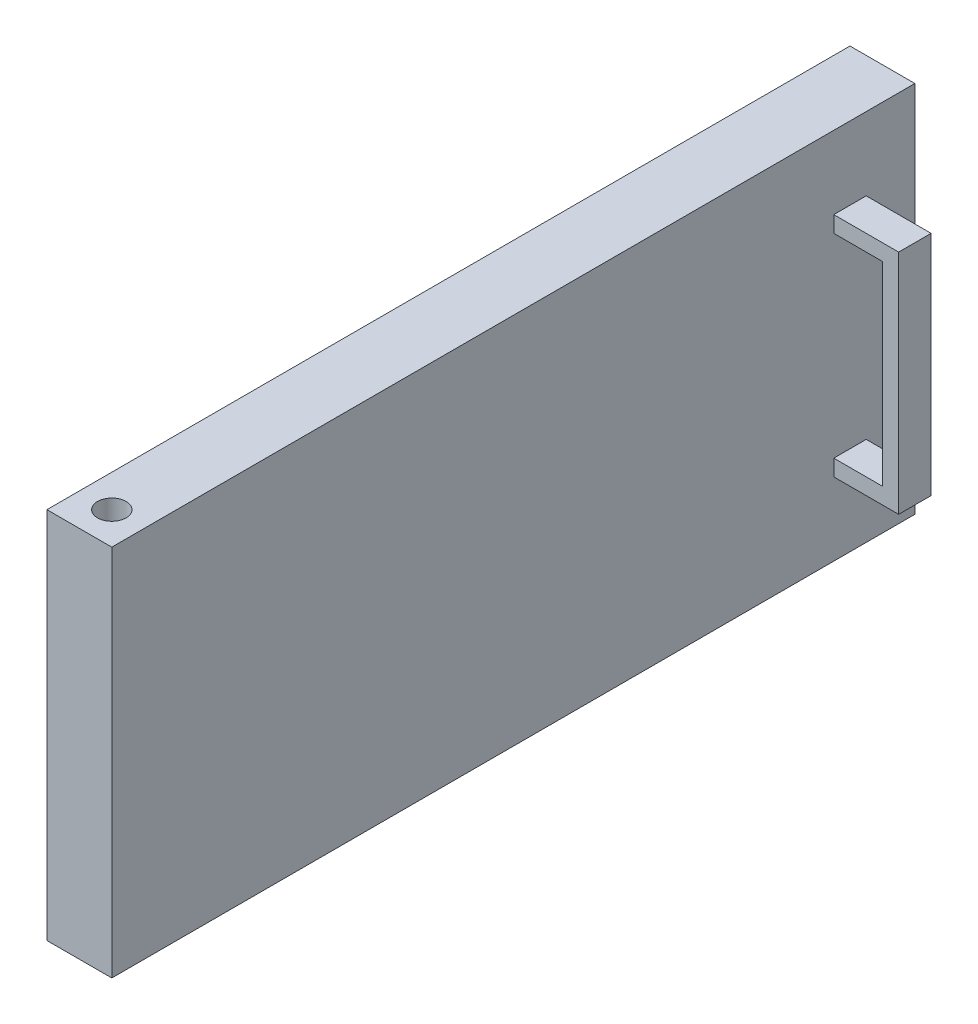
ISO-10303-21;
HEADER;
FILE_DESCRIPTION(('STEP AP214'),'2;1');
FILE_NAME('part.step','',(''),(''),'','','');
FILE_SCHEMA(('AUTOMOTIVE_DESIGN { 1 0 10303 214 1 1 1 1 }'));
ENDSEC;
DATA;
#1=APPLICATION_CONTEXT('core data for automotive mechanical design processes');
#2=APPLICATION_PROTOCOL_DEFINITION('international standard','automotive_design',2000,#1);
#3=PRODUCT_CONTEXT('',#1,'mechanical');
#4=PRODUCT('Part','Part','',(#3));
#5=PRODUCT_RELATED_PRODUCT_CATEGORY('part','',(#4));
#6=PRODUCT_DEFINITION_FORMATION('','',#4);
#7=PRODUCT_DEFINITION_CONTEXT('part definition',#1,'design');
#8=PRODUCT_DEFINITION('design','',#6,#7);
#9=PRODUCT_DEFINITION_SHAPE('','',#8);
#10=(LENGTH_UNIT() NAMED_UNIT(*) SI_UNIT(.MILLI.,.METRE.));
#11=(NAMED_UNIT(*) PLANE_ANGLE_UNIT() SI_UNIT($,.RADIAN.));
#12=(NAMED_UNIT(*) SI_UNIT($,.STERADIAN.) SOLID_ANGLE_UNIT());
#13=UNCERTAINTY_MEASURE_WITH_UNIT(LENGTH_MEASURE(1.E-05),#10,'distance_accuracy_value','');
#14=(GEOMETRIC_REPRESENTATION_CONTEXT(3) GLOBAL_UNCERTAINTY_ASSIGNED_CONTEXT((#13)) GLOBAL_UNIT_ASSIGNED_CONTEXT((#10,
#11,#12)) REPRESENTATION_CONTEXT('',''));
#15=CARTESIAN_POINT('',(0.,0.,0.));
#16=DIRECTION('',(0.,0.,1.));
#17=DIRECTION('',(1.,0.,0.));
#18=AXIS2_PLACEMENT_3D('',#15,#16,#17);
#19=CARTESIAN_POINT('',(20.,0.,0.));
#20=DIRECTION('',(1.,0.,0.));
#21=DIRECTION('',(0.,0.,-1.));
#22=AXIS2_PLACEMENT_3D('',#19,#20,#21);
#23=PLANE('',#22);
#24=DIRECTION('',(0.,-1.,0.));
#25=VECTOR('',#24,1.);
#26=CARTESIAN_POINT('',(20.,35.,-98.7499999999999));
#27=LINE('',#26,#25);
#28=CARTESIAN_POINT('',(20.,-30.,-98.7499999999999));
#29=VERTEX_POINT('',#28);
#30=CARTESIAN_POINT('',(20.,-35.,-98.7499999999999));
#31=VERTEX_POINT('',#30);
#32=EDGE_CURVE('E152',#29,#31,#27,.T.);
#33=ORIENTED_EDGE('',*,*,#32,.F.);
#34=DIRECTION('',(0.,0.,-1.));
#35=VECTOR('',#34,1.);
#36=CARTESIAN_POINT('',(20.,-30.,-88.75));
#37=LINE('',#36,#35);
#38=CARTESIAN_POINT('',(20.,-30.,-108.75));
#39=VERTEX_POINT('',#38);
#40=EDGE_CURVE('E142',#29,#39,#37,.T.);
#41=ORIENTED_EDGE('',*,*,#40,.T.);
#42=DIRECTION('',(0.,1.,0.));
#43=VECTOR('',#42,1.);
#44=CARTESIAN_POINT('',(20.,35.,-108.75));
#45=LINE('',#44,#43);
#46=CARTESIAN_POINT('',(20.,-35.,-108.75));
#47=VERTEX_POINT('',#46);
#48=EDGE_CURVE('E170',#47,#39,#45,.T.);
#49=ORIENTED_EDGE('',*,*,#48,.F.);
#50=DIRECTION('',(0.,0.,-1.));
#51=VECTOR('',#50,1.);
#52=CARTESIAN_POINT('',(20.,-35.,-98.7499999999999));
#53=LINE('',#52,#51);
#54=EDGE_CURVE('E167',#31,#47,#53,.T.);
#55=ORIENTED_EDGE('',*,*,#54,.F.);
#56=EDGE_LOOP('',(#33,#41,#49,#55));
#57=FACE_BOUND('',#56,.T.);
#58=DIRECTION('',(0.,0.,-1.));
#59=VECTOR('',#58,1.);
#60=CARTESIAN_POINT('',(20.,30.,-88.75));
#61=LINE('',#60,#59);
#62=CARTESIAN_POINT('',(20.,30.,-98.7499999999999));
#63=VERTEX_POINT('',#62);
#64=CARTESIAN_POINT('',(20.,30.,-108.75));
#65=VERTEX_POINT('',#64);
#66=EDGE_CURVE('E53',#63,#65,#61,.T.);
#67=ORIENTED_EDGE('',*,*,#66,.F.);
#68=CARTESIAN_POINT('',(20.,35.,-98.7499999999999));
#69=VERTEX_POINT('',#68);
#70=EDGE_CURVE('E164',#69,#63,#27,.T.);
#71=ORIENTED_EDGE('',*,*,#70,.F.);
#72=DIRECTION('',(0.,0.,1.));
#73=VECTOR('',#72,1.);
#74=CARTESIAN_POINT('',(20.,35.,-98.7499999999999));
#75=LINE('',#74,#73);
#76=CARTESIAN_POINT('',(20.,35.,-108.75));
#77=VERTEX_POINT('',#76);
#78=EDGE_CURVE('E157',#77,#69,#75,.T.);
#79=ORIENTED_EDGE('',*,*,#78,.F.);
#80=EDGE_CURVE('E169',#65,#77,#45,.T.);
#81=ORIENTED_EDGE('',*,*,#80,.F.);
#82=EDGE_LOOP('',(#67,#71,#79,#81));
#83=FACE_BOUND('',#82,.T.);
#84=DIRECTION('',(0.,1.,0.));
#85=VECTOR('',#84,1.);
#86=CARTESIAN_POINT('',(20.,57.5,-123.75));
#87=LINE('',#86,#85);
#88=CARTESIAN_POINT('',(20.,-57.5,-123.75));
#89=VERTEX_POINT('',#88);
#90=CARTESIAN_POINT('',(20.,57.5,-123.75));
#91=VERTEX_POINT('',#90);
#92=EDGE_CURVE('E197',#89,#91,#87,.T.);
#93=ORIENTED_EDGE('',*,*,#92,.T.);
#94=DIRECTION('',(0.,0.,1.));
#95=VECTOR('',#94,1.);
#96=CARTESIAN_POINT('',(20.,57.5,123.75));
#97=LINE('',#96,#95);
#98=CARTESIAN_POINT('',(20.,57.5,123.75));
#99=VERTEX_POINT('',#98);
#100=EDGE_CURVE('E200',#91,#99,#97,.T.);
#101=ORIENTED_EDGE('',*,*,#100,.T.);
#102=DIRECTION('',(0.,-1.,0.));
#103=VECTOR('',#102,1.);
#104=CARTESIAN_POINT('',(20.,57.5,123.75));
#105=LINE('',#104,#103);
#106=CARTESIAN_POINT('',(20.,-57.5,123.75));
#107=VERTEX_POINT('',#106);
#108=EDGE_CURVE('E203',#99,#107,#105,.T.);
#109=ORIENTED_EDGE('',*,*,#108,.T.);
#110=DIRECTION('',(0.,0.,-1.));
#111=VECTOR('',#110,1.);
#112=CARTESIAN_POINT('',(20.,-57.5,123.75));
#113=LINE('',#112,#111);
#114=EDGE_CURVE('E205',#107,#89,#113,.T.);
#115=ORIENTED_EDGE('',*,*,#114,.T.);
#116=EDGE_LOOP('',(#93,#101,#109,#115));
#117=FACE_BOUND('',#116,.T.);
#118=ADVANCED_FACE('F33',(#57,#83,#117),#23,.T.);
#119=CARTESIAN_POINT('',(20.,57.5,-123.75));
#120=DIRECTION('',(0.,0.,1.));
#121=DIRECTION('',(0.,-1.,0.));
#122=AXIS2_PLACEMENT_3D('',#119,#120,#121);
#123=PLANE('',#122);
#124=DIRECTION('',(0.,1.,0.));
#125=VECTOR('',#124,1.);
#126=CARTESIAN_POINT('',(0.,57.5,-123.75));
#127=LINE('',#126,#125);
#128=CARTESIAN_POINT('',(0.,-57.5,-123.75));
#129=VERTEX_POINT('',#128);
#130=CARTESIAN_POINT('',(0.,57.5,-123.75));
#131=VERTEX_POINT('',#130);
#132=EDGE_CURVE('E194',#129,#131,#127,.T.);
#133=ORIENTED_EDGE('',*,*,#132,.T.);
#134=DIRECTION('',(-1.,0.,0.));
#135=VECTOR('',#134,1.);
#136=CARTESIAN_POINT('',(20.,57.5,-123.75));
#137=LINE('',#136,#135);
#138=EDGE_CURVE('E11',#91,#131,#137,.T.);
#139=ORIENTED_EDGE('',*,*,#138,.F.);
#140=ORIENTED_EDGE('',*,*,#92,.F.);
#141=DIRECTION('',(-1.,0.,0.));
#142=VECTOR('',#141,1.);
#143=CARTESIAN_POINT('',(20.,-57.5,-123.75));
#144=LINE('',#143,#142);
#145=EDGE_CURVE('E207',#89,#129,#144,.T.);
#146=ORIENTED_EDGE('',*,*,#145,.T.);
#147=EDGE_LOOP('',(#133,#139,#140,#146));
#148=FACE_BOUND('',#147,.T.);
#149=ADVANCED_FACE('F35',(#148),#123,.F.);
#150=CARTESIAN_POINT('',(20.,57.5,123.75));
#151=DIRECTION('',(0.,-1.,0.));
#152=DIRECTION('',(0.,0.,-1.));
#153=AXIS2_PLACEMENT_3D('',#150,#151,#152);
#154=PLANE('',#153);
#155=CARTESIAN_POINT('',(10.,57.5,113.75));
#156=DIRECTION('',(0.,1.,0.));
#157=DIRECTION('',(0.,0.,1.));
#158=AXIS2_PLACEMENT_3D('',#155,#156,#157);
#159=CIRCLE('',#158,4.4);
#160=CARTESIAN_POINT('',(10.,57.5,118.15));
#161=VERTEX_POINT('',#160);
#162=EDGE_CURVE('E188',#161,#161,#159,.T.);
#163=ORIENTED_EDGE('',*,*,#162,.F.);
#164=EDGE_LOOP('',(#163));
#165=FACE_BOUND('',#164,.T.);
#166=DIRECTION('',(0.,0.,1.));
#167=VECTOR('',#166,1.);
#168=CARTESIAN_POINT('',(0.,57.5,123.75));
#169=LINE('',#168,#167);
#170=CARTESIAN_POINT('',(0.,57.5,123.75));
#171=VERTEX_POINT('',#170);
#172=EDGE_CURVE('E210',#131,#171,#169,.T.);
#173=ORIENTED_EDGE('',*,*,#172,.T.);
#174=DIRECTION('',(-1.,0.,0.));
#175=VECTOR('',#174,1.);
#176=CARTESIAN_POINT('',(20.,57.5,123.75));
#177=LINE('',#176,#175);
#178=EDGE_CURVE('E41',#99,#171,#177,.T.);
#179=ORIENTED_EDGE('',*,*,#178,.F.);
#180=ORIENTED_EDGE('',*,*,#100,.F.);
#181=ORIENTED_EDGE('',*,*,#138,.T.);
#182=EDGE_LOOP('',(#173,#179,#180,#181));
#183=FACE_BOUND('',#182,.T.);
#184=ADVANCED_FACE('F239',(#165,#183),#154,.F.);
#185=CARTESIAN_POINT('',(20.,57.5,123.75));
#186=DIRECTION('',(0.,0.,-1.));
#187=DIRECTION('',(0.,1.,0.));
#188=AXIS2_PLACEMENT_3D('',#185,#186,#187);
#189=PLANE('',#188);
#190=DIRECTION('',(0.,-1.,0.));
#191=VECTOR('',#190,1.);
#192=CARTESIAN_POINT('',(0.,57.5,123.75));
#193=LINE('',#192,#191);
#194=CARTESIAN_POINT('',(0.,-57.5,123.75));
#195=VERTEX_POINT('',#194);
#196=EDGE_CURVE('E212',#171,#195,#193,.T.);
#197=ORIENTED_EDGE('',*,*,#196,.T.);
#198=DIRECTION('',(-1.,0.,0.));
#199=VECTOR('',#198,1.);
#200=CARTESIAN_POINT('',(20.,-57.5,123.75));
#201=LINE('',#200,#199);
#202=EDGE_CURVE('E217',#107,#195,#201,.T.);
#203=ORIENTED_EDGE('',*,*,#202,.F.);
#204=ORIENTED_EDGE('',*,*,#108,.F.);
#205=ORIENTED_EDGE('',*,*,#178,.T.);
#206=EDGE_LOOP('',(#197,#203,#204,#205));
#207=FACE_BOUND('',#206,.T.);
#208=ADVANCED_FACE('F224',(#207),#189,.F.);
#209=CARTESIAN_POINT('',(20.,-57.5,123.75));
#210=DIRECTION('',(0.,1.,0.));
#211=DIRECTION('',(0.,0.,1.));
#212=AXIS2_PLACEMENT_3D('',#209,#210,#211);
#213=PLANE('',#212);
#214=CARTESIAN_POINT('',(10.,-57.5,113.75));
#215=DIRECTION('',(0.,-1.,0.));
#216=DIRECTION('',(0.,0.,-1.));
#217=AXIS2_PLACEMENT_3D('',#214,#215,#216);
#218=CIRCLE('',#217,4.4);
#219=CARTESIAN_POINT('',(10.,-57.5,109.35));
#220=VERTEX_POINT('',#219);
#221=EDGE_CURVE('E184',#220,#220,#218,.T.);
#222=ORIENTED_EDGE('',*,*,#221,.F.);
#223=EDGE_LOOP('',(#222));
#224=FACE_BOUND('',#223,.T.);
#225=DIRECTION('',(0.,0.,-1.));
#226=VECTOR('',#225,1.);
#227=CARTESIAN_POINT('',(0.,-57.5,123.75));
#228=LINE('',#227,#226);
#229=EDGE_CURVE('E201',#195,#129,#228,.T.);
#230=ORIENTED_EDGE('',*,*,#229,.T.);
#231=ORIENTED_EDGE('',*,*,#145,.F.);
#232=ORIENTED_EDGE('',*,*,#114,.F.);
#233=ORIENTED_EDGE('',*,*,#202,.T.);
#234=EDGE_LOOP('',(#230,#231,#232,#233));
#235=FACE_BOUND('',#234,.T.);
#236=ADVANCED_FACE('F233',(#224,#235),#213,.F.);
#237=CARTESIAN_POINT('',(0.,0.,0.));
#238=DIRECTION('',(1.,0.,0.));
#239=DIRECTION('',(0.,0.,-1.));
#240=AXIS2_PLACEMENT_3D('',#237,#238,#239);
#241=PLANE('',#240);
#242=ORIENTED_EDGE('',*,*,#132,.F.);
#243=ORIENTED_EDGE('',*,*,#229,.F.);
#244=ORIENTED_EDGE('',*,*,#196,.F.);
#245=ORIENTED_EDGE('',*,*,#172,.F.);
#246=EDGE_LOOP('',(#242,#243,#244,#245));
#247=FACE_BOUND('',#246,.T.);
#248=ADVANCED_FACE('F230',(#247),#241,.F.);
#249=CARTESIAN_POINT('',(10.,40.,113.75));
#250=DIRECTION('',(0.,1.,0.));
#251=DIRECTION('',(0.,0.,1.));
#252=AXIS2_PLACEMENT_3D('',#249,#250,#251);
#253=CYLINDRICAL_SURFACE('',#252,4.4);
#254=CARTESIAN_POINT('',(10.,40.,113.75));
#255=DIRECTION('',(0.,1.,0.));
#256=DIRECTION('',(0.,0.,1.));
#257=AXIS2_PLACEMENT_3D('',#254,#255,#256);
#258=CIRCLE('',#257,4.4);
#259=CARTESIAN_POINT('',(10.,40.,118.15));
#260=VERTEX_POINT('',#259);
#261=EDGE_CURVE('E191',#260,#260,#258,.T.);
#262=ORIENTED_EDGE('',*,*,#261,.F.);
#263=EDGE_LOOP('',(#262));
#264=FACE_BOUND('',#263,.T.);
#265=ORIENTED_EDGE('',*,*,#162,.T.);
#266=EDGE_LOOP('',(#265));
#267=FACE_BOUND('',#266,.T.);
#268=ADVANCED_FACE('F257',(#264,#267),#253,.F.);
#269=CARTESIAN_POINT('',(10.,40.,113.75));
#270=DIRECTION('',(0.,1.,0.));
#271=DIRECTION('',(0.,0.,1.));
#272=AXIS2_PLACEMENT_3D('',#269,#270,#271);
#273=PLANE('',#272);
#274=ORIENTED_EDGE('',*,*,#261,.T.);
#275=EDGE_LOOP('',(#274));
#276=FACE_BOUND('',#275,.T.);
#277=ADVANCED_FACE('F270',(#276),#273,.T.);
#278=CARTESIAN_POINT('',(10.,-40.,113.75));
#279=DIRECTION('',(0.,-1.,0.));
#280=DIRECTION('',(0.,0.,-1.));
#281=AXIS2_PLACEMENT_3D('',#278,#279,#280);
#282=CYLINDRICAL_SURFACE('',#281,4.4);
#283=CARTESIAN_POINT('',(10.,-40.,113.75));
#284=DIRECTION('',(0.,-1.,0.));
#285=DIRECTION('',(0.,0.,-1.));
#286=AXIS2_PLACEMENT_3D('',#283,#284,#285);
#287=CIRCLE('',#286,4.4);
#288=CARTESIAN_POINT('',(10.,-40.,109.35));
#289=VERTEX_POINT('',#288);
#290=EDGE_CURVE('E185',#289,#289,#287,.T.);
#291=ORIENTED_EDGE('',*,*,#290,.F.);
#292=EDGE_LOOP('',(#291));
#293=FACE_BOUND('',#292,.T.);
#294=ORIENTED_EDGE('',*,*,#221,.T.);
#295=EDGE_LOOP('',(#294));
#296=FACE_BOUND('',#295,.T.);
#297=ADVANCED_FACE('F267',(#293,#296),#282,.F.);
#298=CARTESIAN_POINT('',(10.,-40.,113.75));
#299=DIRECTION('',(0.,-1.,0.));
#300=DIRECTION('',(0.,0.,-1.));
#301=AXIS2_PLACEMENT_3D('',#298,#299,#300);
#302=PLANE('',#301);
#303=ORIENTED_EDGE('',*,*,#290,.T.);
#304=EDGE_LOOP('',(#303));
#305=FACE_BOUND('',#304,.T.);
#306=ADVANCED_FACE('F269',(#305),#302,.T.);
#307=CARTESIAN_POINT('',(40.,35.,-98.7499999999999));
#308=DIRECTION('',(0.,0.,-1.));
#309=DIRECTION('',(-1.,0.,0.));
#310=AXIS2_PLACEMENT_3D('',#307,#308,#309);
#311=PLANE('',#310);
#312=DIRECTION('',(0.,-1.,0.));
#313=VECTOR('',#312,1.);
#314=CARTESIAN_POINT('',(35.,35.,-98.7499999999999));
#315=LINE('',#314,#313);
#316=CARTESIAN_POINT('',(35.,30.,-98.7499999999999));
#317=VERTEX_POINT('',#316);
#318=CARTESIAN_POINT('',(35.,-30.,-98.7499999999999));
#319=VERTEX_POINT('',#318);
#320=EDGE_CURVE('E126',#317,#319,#315,.T.);
#321=ORIENTED_EDGE('',*,*,#320,.T.);
#322=DIRECTION('',(-1.,0.,0.));
#323=VECTOR('',#322,1.);
#324=CARTESIAN_POINT('',(40.,-30.,-98.7499999999999));
#325=LINE('',#324,#323);
#326=EDGE_CURVE('E149',#319,#29,#325,.T.);
#327=ORIENTED_EDGE('',*,*,#326,.T.);
#328=ORIENTED_EDGE('',*,*,#32,.T.);
#329=DIRECTION('',(-1.,0.,0.));
#330=VECTOR('',#329,1.);
#331=CARTESIAN_POINT('',(40.,-35.,-98.7499999999999));
#332=LINE('',#331,#330);
#333=CARTESIAN_POINT('',(40.,-35.,-98.7499999999999));
#334=VERTEX_POINT('',#333);
#335=EDGE_CURVE('E181',#334,#31,#332,.T.);
#336=ORIENTED_EDGE('',*,*,#335,.F.);
#337=DIRECTION('',(0.,-1.,0.));
#338=VECTOR('',#337,1.);
#339=CARTESIAN_POINT('',(40.,35.,-98.7499999999999));
#340=LINE('',#339,#338);
#341=CARTESIAN_POINT('',(40.,35.,-98.7499999999999));
#342=VERTEX_POINT('',#341);
#343=EDGE_CURVE('E153',#342,#334,#340,.T.);
#344=ORIENTED_EDGE('',*,*,#343,.F.);
#345=DIRECTION('',(-1.,0.,0.));
#346=VECTOR('',#345,1.);
#347=CARTESIAN_POINT('',(40.,35.,-98.7499999999999));
#348=LINE('',#347,#346);
#349=EDGE_CURVE('E163',#342,#69,#348,.T.);
#350=ORIENTED_EDGE('',*,*,#349,.T.);
#351=ORIENTED_EDGE('',*,*,#70,.T.);
#352=DIRECTION('',(1.,0.,0.));
#353=VECTOR('',#352,1.);
#354=CARTESIAN_POINT('',(40.,30.,-98.7499999999999));
#355=LINE('',#354,#353);
#356=EDGE_CURVE('E144',#63,#317,#355,.T.);
#357=ORIENTED_EDGE('',*,*,#356,.T.);
#358=EDGE_LOOP('',(#321,#327,#328,#336,#344,#350,#351,#357));
#359=FACE_BOUND('',#358,.T.);
#360=ADVANCED_FACE('F277',(#359),#311,.F.);
#361=CARTESIAN_POINT('',(40.,-35.,-98.7499999999999));
#362=DIRECTION('',(0.,1.,0.));
#363=DIRECTION('',(0.,0.,1.));
#364=AXIS2_PLACEMENT_3D('',#361,#362,#363);
#365=PLANE('',#364);
#366=ORIENTED_EDGE('',*,*,#54,.T.);
#367=DIRECTION('',(-1.,0.,0.));
#368=VECTOR('',#367,1.);
#369=CARTESIAN_POINT('',(40.,-35.,-108.75));
#370=LINE('',#369,#368);
#371=CARTESIAN_POINT('',(40.,-35.,-108.75));
#372=VERTEX_POINT('',#371);
#373=EDGE_CURVE('E178',#372,#47,#370,.T.);
#374=ORIENTED_EDGE('',*,*,#373,.F.);
#375=DIRECTION('',(0.,0.,-1.));
#376=VECTOR('',#375,1.);
#377=CARTESIAN_POINT('',(40.,-35.,-98.7499999999999));
#378=LINE('',#377,#376);
#379=EDGE_CURVE('E156',#334,#372,#378,.T.);
#380=ORIENTED_EDGE('',*,*,#379,.F.);
#381=ORIENTED_EDGE('',*,*,#335,.T.);
#382=EDGE_LOOP('',(#366,#374,#380,#381));
#383=FACE_BOUND('',#382,.T.);
#384=ADVANCED_FACE('F285',(#383),#365,.F.);
#385=CARTESIAN_POINT('',(40.,35.,-108.75));
#386=DIRECTION('',(0.,0.,1.));
#387=DIRECTION('',(0.,-1.,0.));
#388=AXIS2_PLACEMENT_3D('',#385,#386,#387);
#389=PLANE('',#388);
#390=ORIENTED_EDGE('',*,*,#48,.T.);
#391=DIRECTION('',(-1.,0.,0.));
#392=VECTOR('',#391,1.);
#393=CARTESIAN_POINT('',(20.,-30.,-108.75));
#394=LINE('',#393,#392);
#395=CARTESIAN_POINT('',(35.,-30.,-108.75));
#396=VERTEX_POINT('',#395);
#397=EDGE_CURVE('E138',#396,#39,#394,.T.);
#398=ORIENTED_EDGE('',*,*,#397,.F.);
#399=DIRECTION('',(0.,-1.,0.));
#400=VECTOR('',#399,1.);
#401=CARTESIAN_POINT('',(35.,30.,-108.75));
#402=LINE('',#401,#400);
#403=CARTESIAN_POINT('',(35.,30.,-108.75));
#404=VERTEX_POINT('',#403);
#405=EDGE_CURVE('E123',#404,#396,#402,.T.);
#406=ORIENTED_EDGE('',*,*,#405,.F.);
#407=DIRECTION('',(1.,0.,0.));
#408=VECTOR('',#407,1.);
#409=CARTESIAN_POINT('',(20.,30.,-108.75));
#410=LINE('',#409,#408);
#411=EDGE_CURVE('E130',#65,#404,#410,.T.);
#412=ORIENTED_EDGE('',*,*,#411,.F.);
#413=ORIENTED_EDGE('',*,*,#80,.T.);
#414=DIRECTION('',(-1.,0.,0.));
#415=VECTOR('',#414,1.);
#416=CARTESIAN_POINT('',(40.,35.,-108.75));
#417=LINE('',#416,#415);
#418=CARTESIAN_POINT('',(40.,35.,-108.75));
#419=VERTEX_POINT('',#418);
#420=EDGE_CURVE('E175',#419,#77,#417,.T.);
#421=ORIENTED_EDGE('',*,*,#420,.F.);
#422=DIRECTION('',(0.,1.,0.));
#423=VECTOR('',#422,1.);
#424=CARTESIAN_POINT('',(40.,35.,-108.75));
#425=LINE('',#424,#423);
#426=EDGE_CURVE('E159',#372,#419,#425,.T.);
#427=ORIENTED_EDGE('',*,*,#426,.F.);
#428=ORIENTED_EDGE('',*,*,#373,.T.);
#429=EDGE_LOOP('',(#390,#398,#406,#412,#413,#421,#427,#428));
#430=FACE_BOUND('',#429,.T.);
#431=ADVANCED_FACE('F136',(#430),#389,.F.);
#432=CARTESIAN_POINT('',(40.,35.,-98.7499999999999));
#433=DIRECTION('',(0.,-1.,0.));
#434=DIRECTION('',(0.,0.,-1.));
#435=AXIS2_PLACEMENT_3D('',#432,#433,#434);
#436=PLANE('',#435);
#437=ORIENTED_EDGE('',*,*,#78,.T.);
#438=ORIENTED_EDGE('',*,*,#349,.F.);
#439=DIRECTION('',(0.,0.,1.));
#440=VECTOR('',#439,1.);
#441=CARTESIAN_POINT('',(40.,35.,-98.7499999999999));
#442=LINE('',#441,#440);
#443=EDGE_CURVE('E161',#419,#342,#442,.T.);
#444=ORIENTED_EDGE('',*,*,#443,.F.);
#445=ORIENTED_EDGE('',*,*,#420,.T.);
#446=EDGE_LOOP('',(#437,#438,#444,#445));
#447=FACE_BOUND('',#446,.T.);
#448=ADVANCED_FACE('F292',(#447),#436,.F.);
#449=CARTESIAN_POINT('',(40.,0.,0.));
#450=DIRECTION('',(1.,0.,0.));
#451=DIRECTION('',(0.,0.,-1.));
#452=AXIS2_PLACEMENT_3D('',#449,#450,#451);
#453=PLANE('',#452);
#454=ORIENTED_EDGE('',*,*,#343,.T.);
#455=ORIENTED_EDGE('',*,*,#379,.T.);
#456=ORIENTED_EDGE('',*,*,#426,.T.);
#457=ORIENTED_EDGE('',*,*,#443,.T.);
#458=EDGE_LOOP('',(#454,#455,#456,#457));
#459=FACE_BOUND('',#458,.T.);
#460=ADVANCED_FACE('F295',(#459),#453,.T.);
#461=CARTESIAN_POINT('',(20.,-30.,-88.75));
#462=DIRECTION('',(0.,-1.,0.));
#463=DIRECTION('',(1.,0.,0.));
#464=AXIS2_PLACEMENT_3D('',#461,#462,#463);
#465=PLANE('',#464);
#466=DIRECTION('',(0.,0.,-1.));
#467=VECTOR('',#466,1.);
#468=CARTESIAN_POINT('',(35.,-30.,-88.75));
#469=LINE('',#468,#467);
#470=EDGE_CURVE('E128',#319,#396,#469,.T.);
#471=ORIENTED_EDGE('',*,*,#470,.T.);
#472=ORIENTED_EDGE('',*,*,#397,.T.);
#473=ORIENTED_EDGE('',*,*,#40,.F.);
#474=ORIENTED_EDGE('',*,*,#326,.F.);
#475=EDGE_LOOP('',(#471,#472,#473,#474));
#476=FACE_BOUND('',#475,.T.);
#477=ADVANCED_FACE('F299',(#476),#465,.F.);
#478=CARTESIAN_POINT('',(35.,30.,-88.75));
#479=DIRECTION('',(1.,0.,0.));
#480=DIRECTION('',(0.,1.,0.));
#481=AXIS2_PLACEMENT_3D('',#478,#479,#480);
#482=PLANE('',#481);
#483=DIRECTION('',(0.,0.,-1.));
#484=VECTOR('',#483,1.);
#485=CARTESIAN_POINT('',(35.,30.,-88.75));
#486=LINE('',#485,#484);
#487=EDGE_CURVE('E48',#317,#404,#486,.T.);
#488=ORIENTED_EDGE('',*,*,#487,.T.);
#489=ORIENTED_EDGE('',*,*,#405,.T.);
#490=ORIENTED_EDGE('',*,*,#470,.F.);
#491=ORIENTED_EDGE('',*,*,#320,.F.);
#492=EDGE_LOOP('',(#488,#489,#490,#491));
#493=FACE_BOUND('',#492,.T.);
#494=ADVANCED_FACE('F120',(#493),#482,.F.);
#495=CARTESIAN_POINT('',(20.,30.,-88.75));
#496=DIRECTION('',(0.,1.,0.));
#497=DIRECTION('',(0.,0.,1.));
#498=AXIS2_PLACEMENT_3D('',#495,#496,#497);
#499=PLANE('',#498);
#500=ORIENTED_EDGE('',*,*,#66,.T.);
#501=ORIENTED_EDGE('',*,*,#411,.T.);
#502=ORIENTED_EDGE('',*,*,#487,.F.);
#503=ORIENTED_EDGE('',*,*,#356,.F.);
#504=EDGE_LOOP('',(#500,#501,#502,#503));
#505=FACE_BOUND('',#504,.T.);
#506=ADVANCED_FACE('F131',(#505),#499,.F.);
#507=CLOSED_SHELL('',(#118,#149,#184,#208,#236,#248,#268,#277,#297,#306,#360,#384,#431,#448,
#460,#477,#494,#506));
#508=MANIFOLD_SOLID_BREP('B2',#507);
#509=ADVANCED_BREP_SHAPE_REPRESENTATION('',(#18,#508),#14);
#510=SHAPE_DEFINITION_REPRESENTATION(#9,#509);
ENDSEC;
END-ISO-10303-21;
